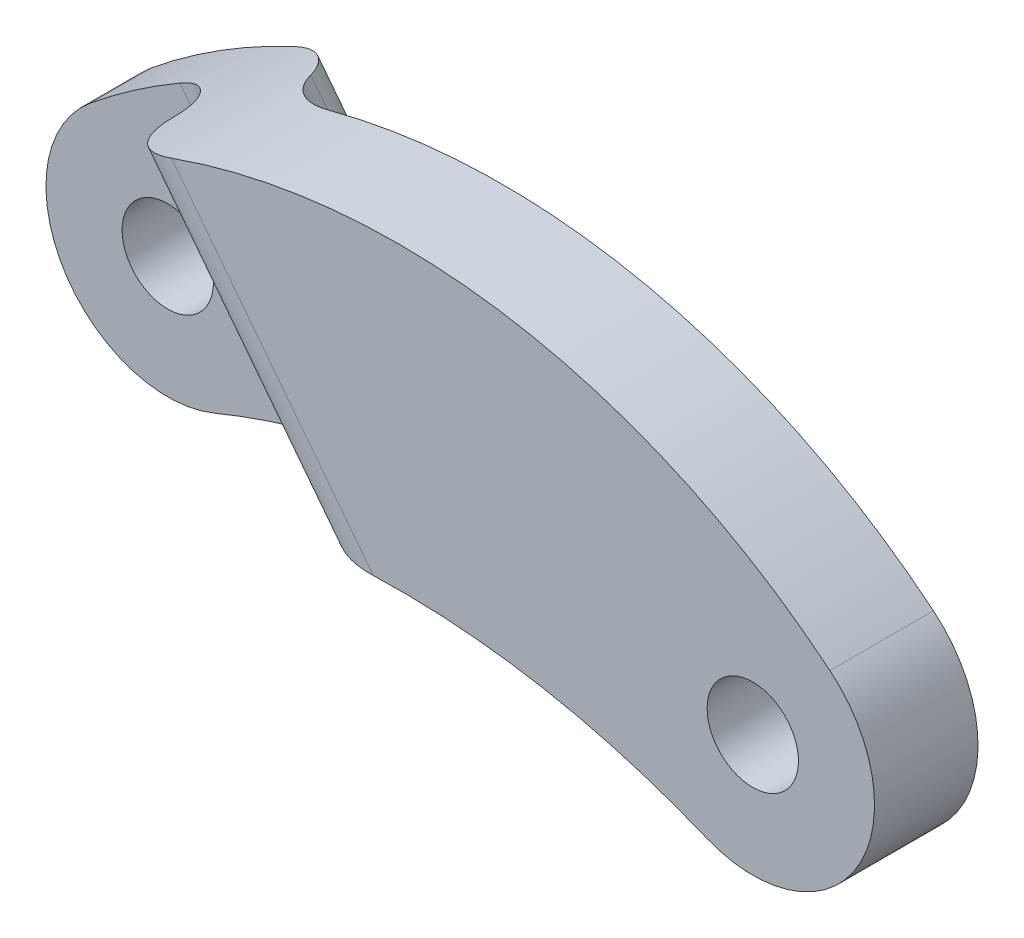
ISO-10303-21;
HEADER;
FILE_DESCRIPTION(('STEP AP214'),'2;1');
FILE_NAME('part.step','',(''),(''),'','','');
FILE_SCHEMA(('AUTOMOTIVE_DESIGN { 1 0 10303 214 1 1 1 1 }'));
ENDSEC;
DATA;
#1=APPLICATION_CONTEXT('core data for automotive mechanical design processes');
#2=APPLICATION_PROTOCOL_DEFINITION('international standard','automotive_design',2000,#1);
#3=PRODUCT_CONTEXT('',#1,'mechanical');
#4=PRODUCT('Part','Part','',(#3));
#5=PRODUCT_RELATED_PRODUCT_CATEGORY('part','',(#4));
#6=PRODUCT_DEFINITION_FORMATION('','',#4);
#7=PRODUCT_DEFINITION_CONTEXT('part definition',#1,'design');
#8=PRODUCT_DEFINITION('design','',#6,#7);
#9=PRODUCT_DEFINITION_SHAPE('','',#8);
#10=(LENGTH_UNIT() NAMED_UNIT(*) SI_UNIT(.MILLI.,.METRE.));
#11=(NAMED_UNIT(*) PLANE_ANGLE_UNIT() SI_UNIT($,.RADIAN.));
#12=(NAMED_UNIT(*) SI_UNIT($,.STERADIAN.) SOLID_ANGLE_UNIT());
#13=UNCERTAINTY_MEASURE_WITH_UNIT(LENGTH_MEASURE(1.E-05),#10,'distance_accuracy_value','');
#14=(GEOMETRIC_REPRESENTATION_CONTEXT(3) GLOBAL_UNCERTAINTY_ASSIGNED_CONTEXT((#13)) GLOBAL_UNIT_ASSIGNED_CONTEXT((#10,
#11,#12)) REPRESENTATION_CONTEXT('',''));
#15=CARTESIAN_POINT('',(0.,0.,0.));
#16=DIRECTION('',(0.,0.,1.));
#17=DIRECTION('',(1.,0.,0.));
#18=AXIS2_PLACEMENT_3D('',#15,#16,#17);
#19=CARTESIAN_POINT('',(0.,0.,0.5));
#20=DIRECTION('',(0.,0.,1.));
#21=DIRECTION('',(-1.,0.,0.));
#22=AXIS2_PLACEMENT_3D('',#19,#20,#21);
#23=PLANE('',#22);
#24=CARTESIAN_POINT('',(-5.80500000000001,-7.08580023417827,0.5));
#25=DIRECTION('',(0.,0.,-1.));
#26=DIRECTION('',(1.,0.,0.));
#27=AXIS2_PLACEMENT_3D('',#24,#25,#26);
#28=CIRCLE('',#27,11.1600540368865);
#29=CARTESIAN_POINT('',(-12.8774597718799,1.54710882832013,0.5));
#30=VERTEX_POINT('',#29);
#31=CARTESIAN_POINT('',(-11.409561525458,2.56488348323696,0.5));
#32=VERTEX_POINT('',#31);
#33=EDGE_CURVE('E149',#30,#32,#28,.T.);
#34=ORIENTED_EDGE('',*,*,#33,.F.);
#35=CARTESIAN_POINT('',(-11.61,0.,0.5));
#36=DIRECTION('',(0.,0.,-1.));
#37=DIRECTION('',(-1.,0.,0.));
#38=AXIS2_PLACEMENT_3D('',#35,#36,#37);
#39=CIRCLE('',#38,2.);
#40=CARTESIAN_POINT('',(-10.8446077432324,-1.8477485470919,0.5));
#41=VERTEX_POINT('',#40);
#42=EDGE_CURVE('E159',#41,#30,#39,.T.);
#43=ORIENTED_EDGE('',*,*,#42,.F.);
#44=CARTESIAN_POINT('',(-5.805,-14.0139650238523,0.5));
#45=DIRECTION('',(0.,0.,-1.));
#46=DIRECTION('',(1.,0.,0.));
#47=AXIS2_PLACEMENT_3D('',#44,#45,#46);
#48=CIRCLE('',#47,13.1686927811778);
#49=CARTESIAN_POINT('',(-8.54411179028973,-1.13329205364845,0.5));
#50=VERTEX_POINT('',#49);
#51=EDGE_CURVE('E260',#41,#50,#48,.T.);
#52=ORIENTED_EDGE('',*,*,#51,.T.);
#53=DIRECTION('',(-0.612486689037816,0.790480901572893,0.));
#54=VECTOR('',#53,1.);
#55=CARTESIAN_POINT('',(-5.88756775120085,-4.56185199571997,0.5));
#56=LINE('',#55,#54);
#57=EDGE_CURVE('E202',#32,#50,#56,.F.);
#58=ORIENTED_EDGE('',*,*,#57,.F.);
#59=EDGE_LOOP('',(#34,#43,#52,#58));
#60=FACE_BOUND('',#59,.T.);
#61=CARTESIAN_POINT('',(-11.61,0.,0.5));
#62=DIRECTION('',(0.,0.,-1.));
#63=DIRECTION('',(-1.,0.,0.));
#64=AXIS2_PLACEMENT_3D('',#61,#62,#63);
#65=CIRCLE('',#64,0.750000000000002);
#66=CARTESIAN_POINT('',(-12.36,0.,0.5));
#67=VERTEX_POINT('',#66);
#68=EDGE_CURVE('E153',#67,#67,#65,.T.);
#69=ORIENTED_EDGE('',*,*,#68,.T.);
#70=EDGE_LOOP('',(#69));
#71=FACE_BOUND('',#70,.T.);
#72=ADVANCED_FACE('F35',(#60,#71),#23,.T.);
#73=CARTESIAN_POINT('',(0.,0.,-0.5));
#74=DIRECTION('',(0.,0.,1.));
#75=DIRECTION('',(-1.,0.,0.));
#76=AXIS2_PLACEMENT_3D('',#73,#74,#75);
#77=PLANE('',#76);
#78=CARTESIAN_POINT('',(-5.805,-14.0139650238523,-0.5));
#79=DIRECTION('',(0.,0.,-1.));
#80=DIRECTION('',(1.,0.,0.));
#81=AXIS2_PLACEMENT_3D('',#78,#79,#80);
#82=CIRCLE('',#81,13.1686927811778);
#83=CARTESIAN_POINT('',(-10.8446077432324,-1.8477485470919,-0.5));
#84=VERTEX_POINT('',#83);
#85=CARTESIAN_POINT('',(-7.42474680096433,-0.945266164906543,-0.5));
#86=VERTEX_POINT('',#85);
#87=EDGE_CURVE('E261',#84,#86,#82,.T.);
#88=ORIENTED_EDGE('',*,*,#87,.F.);
#89=CARTESIAN_POINT('',(-11.61,0.,-0.5));
#90=DIRECTION('',(0.,0.,-1.));
#91=DIRECTION('',(-1.,0.,0.));
#92=AXIS2_PLACEMENT_3D('',#89,#90,#91);
#93=CIRCLE('',#92,2.);
#94=CARTESIAN_POINT('',(-12.8774597718799,1.54710882832013,-0.5));
#95=VERTEX_POINT('',#94);
#96=EDGE_CURVE('E156',#84,#95,#93,.T.);
#97=ORIENTED_EDGE('',*,*,#96,.T.);
#98=CARTESIAN_POINT('',(-5.80500000000001,-7.08580023417827,-0.5));
#99=DIRECTION('',(0.,0.,-1.));
#100=DIRECTION('',(1.,0.,0.));
#101=AXIS2_PLACEMENT_3D('',#98,#99,#100);
#102=CIRCLE('',#101,11.1600540368865);
#103=CARTESIAN_POINT('',(-10.5085085495051,3.03466484559743,-0.5));
#104=VERTEX_POINT('',#103);
#105=EDGE_CURVE('E144',#95,#104,#102,.T.);
#106=ORIENTED_EDGE('',*,*,#105,.T.);
#107=DIRECTION('',(-0.612486689037816,0.790480901572893,0.));
#108=VECTOR('',#107,1.);
#109=CARTESIAN_POINT('',(-5.09708684962795,-3.94936530668216,-0.5));
#110=LINE('',#109,#108);
#111=EDGE_CURVE('E162',#86,#104,#110,.T.);
#112=ORIENTED_EDGE('',*,*,#111,.F.);
#113=EDGE_LOOP('',(#88,#97,#106,#112));
#114=FACE_BOUND('',#113,.T.);
#115=CARTESIAN_POINT('',(-11.61,0.,-0.5));
#116=DIRECTION('',(0.,0.,-1.));
#117=DIRECTION('',(-1.,0.,0.));
#118=AXIS2_PLACEMENT_3D('',#115,#116,#117);
#119=CIRCLE('',#118,0.750000000000002);
#120=CARTESIAN_POINT('',(-12.36,0.,-0.5));
#121=VERTEX_POINT('',#120);
#122=EDGE_CURVE('E146',#121,#121,#119,.T.);
#123=ORIENTED_EDGE('',*,*,#122,.F.);
#124=EDGE_LOOP('',(#123));
#125=FACE_BOUND('',#124,.T.);
#126=ADVANCED_FACE('F220',(#114,#125),#77,.F.);
#127=CARTESIAN_POINT('',(0.,0.,0.5));
#128=DIRECTION('',(0.,0.,-1.));
#129=DIRECTION('',(1.,0.,0.));
#130=AXIS2_PLACEMENT_3D('',#127,#128,#129);
#131=CYLINDRICAL_SURFACE('',#130,2.);
#132=DIRECTION('',(0.,0.,1.));
#133=VECTOR('',#132,1.);
#134=CARTESIAN_POINT('',(1.26745977187993,1.54710882832013,-0.5));
#135=LINE('',#134,#133);
#136=CARTESIAN_POINT('',(1.26745977187993,1.54710882832013,0.8));
#137=VERTEX_POINT('',#136);
#138=CARTESIAN_POINT('',(1.26745977187993,1.54710882832013,2.5));
#139=VERTEX_POINT('',#138);
#140=EDGE_CURVE('E132',#137,#139,#135,.T.);
#141=ORIENTED_EDGE('',*,*,#140,.T.);
#142=CARTESIAN_POINT('',(0.,0.,2.5));
#143=DIRECTION('',(0.,0.,-1.));
#144=DIRECTION('',(-1.,0.,0.));
#145=AXIS2_PLACEMENT_3D('',#142,#143,#144);
#146=CIRCLE('',#145,2.);
#147=CARTESIAN_POINT('',(-0.765392256767593,-1.8477485470919,2.5));
#148=VERTEX_POINT('',#147);
#149=EDGE_CURVE('E268',#139,#148,#146,.T.);
#150=ORIENTED_EDGE('',*,*,#149,.T.);
#151=DIRECTION('',(0.,0.,1.));
#152=VECTOR('',#151,1.);
#153=CARTESIAN_POINT('',(-0.765392256767595,-1.8477485470919,-0.5));
#154=LINE('',#153,#152);
#155=CARTESIAN_POINT('',(-0.765392256767593,-1.8477485470919,0.8));
#156=VERTEX_POINT('',#155);
#157=EDGE_CURVE('E134',#156,#148,#154,.T.);
#158=ORIENTED_EDGE('',*,*,#157,.F.);
#159=CARTESIAN_POINT('',(0.,0.,0.8));
#160=DIRECTION('',(0.,0.,-1.));
#161=DIRECTION('',(-1.,0.,0.));
#162=AXIS2_PLACEMENT_3D('',#159,#160,#161);
#163=CIRCLE('',#162,2.);
#164=EDGE_CURVE('E120',#137,#156,#163,.T.);
#165=ORIENTED_EDGE('',*,*,#164,.F.);
#166=EDGE_LOOP('',(#141,#150,#158,#165));
#167=FACE_BOUND('',#166,.T.);
#168=ADVANCED_FACE('F130',(#167),#131,.T.);
#169=CARTESIAN_POINT('',(-11.61,0.,0.5));
#170=DIRECTION('',(0.,0.,-1.));
#171=DIRECTION('',(1.,0.,0.));
#172=AXIS2_PLACEMENT_3D('',#169,#170,#171);
#173=CYLINDRICAL_SURFACE('',#172,2.);
#174=ORIENTED_EDGE('',*,*,#96,.F.);
#175=DIRECTION('',(0.,0.,1.));
#176=VECTOR('',#175,1.);
#177=CARTESIAN_POINT('',(-10.8446077432324,-1.8477485470919,-0.5));
#178=LINE('',#177,#176);
#179=EDGE_CURVE('E265',#84,#41,#178,.T.);
#180=ORIENTED_EDGE('',*,*,#179,.T.);
#181=ORIENTED_EDGE('',*,*,#42,.T.);
#182=DIRECTION('',(0.,0.,1.));
#183=VECTOR('',#182,1.);
#184=CARTESIAN_POINT('',(-12.8774597718799,1.54710882832013,-0.5));
#185=LINE('',#184,#183);
#186=EDGE_CURVE('E143',#95,#30,#185,.T.);
#187=ORIENTED_EDGE('',*,*,#186,.F.);
#188=EDGE_LOOP('',(#174,#180,#181,#187));
#189=FACE_BOUND('',#188,.T.);
#190=ADVANCED_FACE('F232',(#189),#173,.T.);
#191=CARTESIAN_POINT('',(0.,0.,0.5));
#192=DIRECTION('',(0.,0.,-1.));
#193=DIRECTION('',(1.,0.,0.));
#194=AXIS2_PLACEMENT_3D('',#191,#192,#193);
#195=CYLINDRICAL_SURFACE('',#194,0.75);
#196=CARTESIAN_POINT('',(0.,0.,0.8));
#197=DIRECTION('',(0.,0.,-1.));
#198=DIRECTION('',(-1.,0.,0.));
#199=AXIS2_PLACEMENT_3D('',#196,#197,#198);
#200=CIRCLE('',#199,0.75);
#201=CARTESIAN_POINT('',(-0.75,0.,0.8));
#202=VERTEX_POINT('',#201);
#203=EDGE_CURVE('E281',#202,#202,#200,.T.);
#204=ORIENTED_EDGE('',*,*,#203,.T.);
#205=EDGE_LOOP('',(#204));
#206=FACE_BOUND('',#205,.T.);
#207=CARTESIAN_POINT('',(0.,0.,2.5));
#208=DIRECTION('',(0.,0.,-1.));
#209=DIRECTION('',(-1.,0.,0.));
#210=AXIS2_PLACEMENT_3D('',#207,#208,#209);
#211=CIRCLE('',#210,0.75);
#212=CARTESIAN_POINT('',(-0.75,0.,2.5));
#213=VERTEX_POINT('',#212);
#214=EDGE_CURVE('E284',#213,#213,#211,.T.);
#215=ORIENTED_EDGE('',*,*,#214,.F.);
#216=EDGE_LOOP('',(#215));
#217=FACE_BOUND('',#216,.T.);
#218=ADVANCED_FACE('F230',(#206,#217),#195,.F.);
#219=CARTESIAN_POINT('',(-11.61,0.,0.5));
#220=DIRECTION('',(0.,0.,-1.));
#221=DIRECTION('',(1.,0.,0.));
#222=AXIS2_PLACEMENT_3D('',#219,#220,#221);
#223=CYLINDRICAL_SURFACE('',#222,0.750000000000002);
#224=ORIENTED_EDGE('',*,*,#68,.F.);
#225=EDGE_LOOP('',(#224));
#226=FACE_BOUND('',#225,.T.);
#227=ORIENTED_EDGE('',*,*,#122,.T.);
#228=EDGE_LOOP('',(#227));
#229=FACE_BOUND('',#228,.T.);
#230=ADVANCED_FACE('F187',(#226,#229),#223,.F.);
#231=CARTESIAN_POINT('',(-5.80500000000001,-7.08580023417827,-0.5));
#232=DIRECTION('',(0.,0.,1.));
#233=DIRECTION('',(-1.,0.,0.));
#234=AXIS2_PLACEMENT_3D('',#231,#232,#233);
#235=CYLINDRICAL_SURFACE('',#234,11.1600540368865);
#236=ORIENTED_EDGE('',*,*,#105,.F.);
#237=ORIENTED_EDGE('',*,*,#186,.T.);
#238=ORIENTED_EDGE('',*,*,#33,.T.);
#239=CARTESIAN_POINT('',(-10.5085085495051,3.03466484559743,1.5));
#240=CARTESIAN_POINT('',(-10.5085079821643,3.03466443992367,1.47231611605151));
#241=CARTESIAN_POINT('',(-10.509578539391,3.0341676381714,1.44464574662319));
#242=CARTESIAN_POINT('',(-10.5138445706943,3.03218361238759,1.3895082622763));
#243=CARTESIAN_POINT('',(-10.5170397974425,3.03069650363563,1.36204112407624));
#244=CARTESIAN_POINT('',(-10.5297657242431,3.02476295467184,1.28033488413742));
#245=CARTESIAN_POINT('',(-10.5424368653114,3.01884425450083,1.22665150853327));
#246=CARTESIAN_POINT('',(-10.5756898838789,3.00318670254221,1.12240899322599));
#247=CARTESIAN_POINT('',(-10.5962729563652,2.99344727368213,1.07185032680633));
#248=CARTESIAN_POINT('',(-10.6446233606778,2.97032065843732,0.975193292122565));
#249=CARTESIAN_POINT('',(-10.6723913485879,2.95693313892467,0.929095331712096));
#250=CARTESIAN_POINT('',(-10.7345968263325,2.92654672762075,0.841995767513028));
#251=CARTESIAN_POINT('',(-10.7691175658354,2.90950247062166,0.801069521491699));
#252=CARTESIAN_POINT('',(-10.8434925496988,2.8722179701158,0.72608035945098));
#253=CARTESIAN_POINT('',(-10.8833482000331,2.85197688385599,0.692019258636275));
#254=CARTESIAN_POINT('',(-10.9680629441004,2.80823353494426,0.631009018741774));
#255=CARTESIAN_POINT('',(-11.013009337538,2.78467185600187,0.604223748718969));
#256=CARTESIAN_POINT('',(-11.1058430609583,2.73512797388139,0.559465265795672));
#257=CARTESIAN_POINT('',(-11.1537288651537,2.70914702293657,0.54148752389495));
#258=CARTESIAN_POINT('',(-11.2364880243384,2.66341844787549,0.518827086077654));
#259=CARTESIAN_POINT('',(-11.2709822205243,2.64412313661005,0.511778229823213));
#260=CARTESIAN_POINT('',(-11.3402033737145,2.60491335431612,0.502364024312786));
#261=CARTESIAN_POINT('',(-11.374930020999,2.58499961323456,0.49999335185671));
#262=CARTESIAN_POINT('',(-11.409561525458,2.56488348323696,0.5));
#263=B_SPLINE_CURVE_WITH_KNOTS('',3,(#239,#240,#241,#242,#243,#244,#245,#246,#247,#248,#249,
#250,#251,#252,#253,#254,#255,#256,#257,#258,#259,#260,#261,#262),.UNSPECIFIED.,.F.,.F.,(4,2,2,
2,2,2,2,2,2,2,2,4),(0.,0.0829998028282258,0.165989945510503,0.331557292873975,0.497149656712741,
0.662757146802546,0.830552065641355,0.998391292895606,1.16974525724486,1.34101101536481,
1.46119089358887,1.58123394279946),.UNSPECIFIED.);
#264=CARTESIAN_POINT('',(-10.5085085495051,3.03466484559743,1.5));
#265=VERTEX_POINT('',#264);
#266=EDGE_CURVE('E48',#265,#32,#263,.T.);
#267=ORIENTED_EDGE('',*,*,#266,.F.);
#268=CARTESIAN_POINT('',(-9.54808119356654,3.42781709215597,2.5));
#269=CARTESIAN_POINT('',(-9.60479113928533,3.40764729536137,2.50004466491557));
#270=CARTESIAN_POINT('',(-9.66134807675275,3.38697524235907,2.49509619546598));
#271=CARTESIAN_POINT('',(-9.7726530375485,3.34530504808339,2.47534028925758));
#272=CARTESIAN_POINT('',(-9.82739914336134,3.3243065937048,2.46052273200392));
#273=CARTESIAN_POINT('',(-9.93353735035689,3.28267467020534,2.4211264560919));
#274=CARTESIAN_POINT('',(-9.9849242198029,3.26204180524963,2.39653291493059));
#275=CARTESIAN_POINT('',(-10.082654603678,3.22202486408923,2.33812752979995));
#276=CARTESIAN_POINT('',(-10.1290022964875,3.20263975879507,2.3043234058774));
#277=CARTESIAN_POINT('',(-10.2138251008774,3.16657163373209,2.22959565288845));
#278=CARTESIAN_POINT('',(-10.2525076857137,3.14982110291029,2.18894020604948));
#279=CARTESIAN_POINT('',(-10.3226578803333,3.11905373631276,2.10089282178147));
#280=CARTESIAN_POINT('',(-10.3541241778452,3.10503739781499,2.05349966164348));
#281=CARTESIAN_POINT('',(-10.4079111552897,3.08085398540459,1.95511546541881));
#282=CARTESIAN_POINT('',(-10.430508724499,3.07057128319713,1.90430380427422));
#283=CARTESIAN_POINT('',(-10.4673865561996,3.05369545668609,1.79919538324296));
#284=CARTESIAN_POINT('',(-10.4816749731903,3.04709871527602,1.74490209849027));
#285=CARTESIAN_POINT('',(-10.4972319321875,3.03989982669158,1.65846142834048));
#286=CARTESIAN_POINT('',(-10.5014596976246,3.03793860201241,1.62692543100499));
#287=CARTESIAN_POINT('',(-10.5070963360006,3.0353212397165,1.56359799644812));
#288=CARTESIAN_POINT('',(-10.5085095460513,3.03466309411866,1.53180702815453));
#289=CARTESIAN_POINT('',(-10.5085085495051,3.03466484559743,1.5));
#290=B_SPLINE_CURVE_WITH_KNOTS('',3,(#268,#269,#270,#271,#272,#273,#274,#275,#276,#277,#278,
#279,#280,#281,#282,#283,#284,#285,#286,#287,#288,#289),.UNSPECIFIED.,.F.,.F.,(4,2,2,2,2,2,2,2,
2,2,4),(0.,0.180402825065742,0.360990933993724,0.541853904341653,0.722565744398397,
0.897383264136049,1.07223254901905,1.24107913791347,1.40975974198445,1.50525834491122,
1.60060967427656),.UNSPECIFIED.);
#291=CARTESIAN_POINT('',(-9.54808119356654,3.42781709215597,2.5));
#292=VERTEX_POINT('',#291);
#293=EDGE_CURVE('E167',#292,#265,#290,.T.);
#294=ORIENTED_EDGE('',*,*,#293,.F.);
#295=CARTESIAN_POINT('',(-5.80500000000001,-7.08580023417827,2.5));
#296=DIRECTION('',(0.,0.,-1.));
#297=DIRECTION('',(-1.,0.,0.));
#298=AXIS2_PLACEMENT_3D('',#295,#296,#297);
#299=CIRCLE('',#298,11.1600540368865);
#300=EDGE_CURVE('E141',#292,#139,#299,.T.);
#301=ORIENTED_EDGE('',*,*,#300,.T.);
#302=ORIENTED_EDGE('',*,*,#140,.F.);
#303=CARTESIAN_POINT('',(-5.80500000000001,-7.08580023417827,0.8));
#304=DIRECTION('',(0.,0.,-1.));
#305=DIRECTION('',(-1.,0.,0.));
#306=AXIS2_PLACEMENT_3D('',#303,#304,#305);
#307=CIRCLE('',#306,11.1600540368865);
#308=CARTESIAN_POINT('',(-8.65683845296873,3.70372355255096,0.8));
#309=VERTEX_POINT('',#308);
#310=EDGE_CURVE('E116',#309,#137,#307,.T.);
#311=ORIENTED_EDGE('',*,*,#310,.F.);
#312=CARTESIAN_POINT('',(-9.61066818006019,3.40532438663833,0.15));
#313=CARTESIAN_POINT('',(-9.60104391336495,3.40881513212217,0.176085519654819));
#314=CARTESIAN_POINT('',(-9.59035270948725,3.41267886889881,0.201711384994293));
#315=CARTESIAN_POINT('',(-9.56692228490636,3.42109770255776,0.251883180060699));
#316=CARTESIAN_POINT('',(-9.55418357356539,3.4256526274762,0.276429376449546));
#317=CARTESIAN_POINT('',(-9.51311083071071,3.4402418270236,0.348062977268186));
#318=CARTESIAN_POINT('',(-9.48185314641106,3.45122516300105,0.393325980241011));
#319=CARTESIAN_POINT('',(-9.4125827096049,3.47514153822328,0.477657776101736));
#320=CARTESIAN_POINT('',(-9.37457331896887,3.4880736066538,0.516729633505074));
#321=CARTESIAN_POINT('',(-9.29289466341916,3.51529629407549,0.587873425484103));
#322=CARTESIAN_POINT('',(-9.24922349954141,3.529587368448,0.619943001757442));
#323=CARTESIAN_POINT('',(-9.15586292799793,3.55943368433884,0.677444969317043));
#324=CARTESIAN_POINT('',(-9.1060176386546,3.57501555106899,0.702609523057617));
#325=CARTESIAN_POINT('',(-9.00292882872925,3.60639124509719,0.744433990444252));
#326=CARTESIAN_POINT('',(-8.94968442431669,3.6221851266729,0.761091681938328));
#327=CARTESIAN_POINT('',(-8.85635965322597,3.64908058369192,0.782322576424806));
#328=CARTESIAN_POINT('',(-8.81675765428668,3.66026027275357,0.788971798337664));
#329=CARTESIAN_POINT('',(-8.73707083994223,3.68227710299579,0.797806425010267));
#330=CARTESIAN_POINT('',(-8.69698747212269,3.69311502773634,0.800002902382102));
#331=CARTESIAN_POINT('',(-8.65683845296873,3.70372355255096,0.8));
#332=B_SPLINE_CURVE_WITH_KNOTS('',3,(#312,#313,#314,#315,#316,#317,#318,#319,#320,#321,#322,
#323,#324,#325,#326,#327,#328,#329,#330,#331),.UNSPECIFIED.,.F.,.F.,(4,2,2,2,2,2,2,2,2,4),(0.,
0.084012468830498,0.168004069980026,0.335412368609916,0.502737542267542,0.670118982841301,
0.843288013287649,1.01650225562468,1.14132138333945,1.26582974147891),.UNSPECIFIED.);
#333=CARTESIAN_POINT('',(-9.61066818006019,3.40532438663833,0.150000000000001));
#334=VERTEX_POINT('',#333);
#335=EDGE_CURVE('E195',#334,#309,#332,.T.);
#336=ORIENTED_EDGE('',*,*,#335,.F.);
#337=CARTESIAN_POINT('',(-10.5085085495051,3.03466484559743,-0.5));
#338=CARTESIAN_POINT('',(-10.4545997913314,3.05973895002356,-0.500038307200525));
#339=CARTESIAN_POINT('',(-10.4004991351627,3.08433910603536,-0.494961999885077));
#340=CARTESIAN_POINT('',(-10.2934827304667,3.13201024938711,-0.474986815324863));
#341=CARTESIAN_POINT('',(-10.2405663411904,3.15508207755746,-0.460093389332842));
#342=CARTESIAN_POINT('',(-10.1374120896524,3.19914943907394,-0.420885271336029));
#343=CARTESIAN_POINT('',(-10.0871748457609,3.22014449403035,-0.396568414935799));
#344=CARTESIAN_POINT('',(-9.99090245106407,3.25962039999629,-0.33916165681637));
#345=CARTESIAN_POINT('',(-9.94486686555581,3.27810151119532,-0.306072664047405));
#346=CARTESIAN_POINT('',(-9.85852226097701,3.31217652495307,-0.231988760963064));
#347=CARTESIAN_POINT('',(-9.81820664943204,3.3277737576782,-0.191003082518444));
#348=CARTESIAN_POINT('',(-9.74466284481199,3.35581916156376,-0.102143245266141));
#349=CARTESIAN_POINT('',(-9.71143499904493,3.36826717841484,-0.0542687490914888));
#350=CARTESIAN_POINT('',(-9.65429153012761,3.38944029916484,0.0454597621794512));
#351=CARTESIAN_POINT('',(-9.63012023971885,3.39826841148349,0.0971454374043927));
#352=CARTESIAN_POINT('',(-9.59071155312003,3.41256338698437,0.204223596234319));
#353=CARTESIAN_POINT('',(-9.57546274942595,3.41803454251251,0.259611245370437));
#354=CARTESIAN_POINT('',(-9.55938610441248,3.42378701122959,0.346264680392394));
#355=CARTESIAN_POINT('',(-9.5551505994438,3.42529822380831,0.376857090287763));
#356=CARTESIAN_POINT('',(-9.54949872009529,3.4273124958907,0.438294114106932));
#357=CARTESIAN_POINT('',(-9.54807871887972,3.4278168523977,0.469138352108181));
#358=CARTESIAN_POINT('',(-9.54808119356653,3.42781709215597,0.5));
#359=B_SPLINE_CURVE_WITH_KNOTS('',3,(#337,#338,#339,#340,#341,#342,#343,#344,#345,#346,#347,
#348,#349,#350,#351,#352,#353,#354,#355,#356,#357,#358),.UNSPECIFIED.,.F.,.F.,(4,2,2,2,2,2,2,2,
2,2,4),(0.,0.178110237207162,0.356121656526966,0.534173986179928,0.712207873632867,
0.890034874192797,1.06787058646342,1.24021984957285,1.41234827791813,1.50498191224225,
1.59749614135646),.UNSPECIFIED.);
#360=EDGE_CURVE('E175',#104,#334,#359,.T.);
#361=ORIENTED_EDGE('',*,*,#360,.F.);
#362=EDGE_LOOP('',(#236,#237,#238,#267,#294,#301,#302,#311,#336,#361));
#363=FACE_BOUND('',#362,.T.);
#364=ADVANCED_FACE('F138',(#363),#235,.T.);
#365=CARTESIAN_POINT('',(-5.805,-14.0139650238523,-0.5));
#366=DIRECTION('',(0.,0.,1.));
#367=DIRECTION('',(-1.,0.,0.));
#368=AXIS2_PLACEMENT_3D('',#365,#366,#367);
#369=CYLINDRICAL_SURFACE('',#368,13.1686927811778);
#370=CARTESIAN_POINT('',(-5.805,-14.0139650238523,0.8));
#371=DIRECTION('',(0.,0.,1.));
#372=DIRECTION('',(-1.,0.,0.));
#373=AXIS2_PLACEMENT_3D('',#370,#371,#372);
#374=CIRCLE('',#373,13.1686927811778);
#375=CARTESIAN_POINT('',(-5.11826569497717,-0.863190690781676,0.8));
#376=VERTEX_POINT('',#375);
#377=EDGE_CURVE('E135',#156,#376,#374,.T.);
#378=ORIENTED_EDGE('',*,*,#377,.F.);
#379=ORIENTED_EDGE('',*,*,#157,.T.);
#380=CARTESIAN_POINT('',(-5.805,-14.0139650238523,2.5));
#381=DIRECTION('',(0.,0.,1.));
#382=DIRECTION('',(-1.,0.,0.));
#383=AXIS2_PLACEMENT_3D('',#380,#381,#382);
#384=CIRCLE('',#383,13.1686927811778);
#385=CARTESIAN_POINT('',(-6.23181151562507,-0.852190770539253,2.5));
#386=VERTEX_POINT('',#385);
#387=EDGE_CURVE('E262',#148,#386,#384,.T.);
#388=ORIENTED_EDGE('',*,*,#387,.T.);
#389=CARTESIAN_POINT('',(-7.42474680096433,-0.945266164906542,1.5));
#390=CARTESIAN_POINT('',(-7.42474824378731,-0.945266805260724,1.5251876114769));
#391=CARTESIAN_POINT('',(-7.42364760094938,-0.945129883128837,1.55036213796094));
#392=CARTESIAN_POINT('',(-7.41926783501788,-0.944587983045424,1.60051057315308));
#393=CARTESIAN_POINT('',(-7.41598936885114,-0.944183085927016,1.62548454006029));
#394=CARTESIAN_POINT('',(-7.40296791242617,-0.942582209871265,1.69962114137935));
#395=CARTESIAN_POINT('',(-7.39003827036568,-0.940999900524855,1.74825137526711));
#396=CARTESIAN_POINT('',(-7.35628758605538,-0.936952357713761,1.84256346119557));
#397=CARTESIAN_POINT('',(-7.33547223004426,-0.934487760520435,1.88824741003447));
#398=CARTESIAN_POINT('',(-7.28682787878807,-0.928887515436232,1.97569551630254));
#399=CARTESIAN_POINT('',(-7.25899338327209,-0.925751341582929,2.01745656431781));
#400=CARTESIAN_POINT('',(-7.19590447943489,-0.918893270451528,2.09811120771486));
#401=CARTESIAN_POINT('',(-7.16036195753881,-0.915150719694756,2.1367765580781));
#402=CARTESIAN_POINT('',(-7.08397796696187,-0.907472013976818,2.20838893250842));
#403=CARTESIAN_POINT('',(-7.04313619660805,-0.903535848001549,2.24133563077714));
#404=CARTESIAN_POINT('',(-6.95171261162994,-0.895204278481867,2.30518013871335));
#405=CARTESIAN_POINT('',(-6.90055499967352,-0.890815811476065,2.33525260871471));
#406=CARTESIAN_POINT('',(-6.79437103325472,-0.882382057794862,2.38777365229687));
#407=CARTESIAN_POINT('',(-6.73933781510464,-0.878337409466836,2.41020826750891));
#408=CARTESIAN_POINT('',(-6.61040895197262,-0.869725814924579,2.45295236657057));
#409=CARTESIAN_POINT('',(-6.53567152918667,-0.865347561763234,2.47075877370386));
#410=CARTESIAN_POINT('',(-6.38450619811651,-0.857805138771778,2.49426593823586));
#411=CARTESIAN_POINT('',(-6.30808516338805,-0.854636751207356,2.50000907078756));
#412=CARTESIAN_POINT('',(-6.23181151562507,-0.852190770539256,2.5));
#413=B_SPLINE_CURVE_WITH_KNOTS('',3,(#389,#390,#391,#392,#393,#394,#395,#396,#397,#398,#399,
#400,#401,#402,#403,#404,#405,#406,#407,#408,#409,#410,#411,#412),.UNSPECIFIED.,.F.,.F.,(4,2,2,
2,2,2,2,2,2,2,2,4),(0.,0.075512914475057,0.151003061287907,0.301235016897313,0.451358848653137,
0.601600686560247,0.75893094537527,0.916270164541143,1.09409584748994,1.27224478836875,
1.50205736322303,1.73106130675919),.UNSPECIFIED.);
#414=CARTESIAN_POINT('',(-7.42474680096433,-0.945266164906542,1.5));
#415=VERTEX_POINT('',#414);
#416=EDGE_CURVE('E248',#415,#386,#413,.T.);
#417=ORIENTED_EDGE('',*,*,#416,.F.);
#418=CARTESIAN_POINT('',(-8.54411179028973,-1.13329205364845,0.5));
#419=CARTESIAN_POINT('',(-8.47620645867082,-1.11883042336752,0.499991154604004));
#420=CARTESIAN_POINT('',(-8.40819210493737,-1.10494910049924,0.505864592847744));
#421=CARTESIAN_POINT('',(-8.273730489546,-1.07857190118771,0.529045048238693));
#422=CARTESIAN_POINT('',(-8.20728631081606,-1.0660785966128,0.546372889815682));
#423=CARTESIAN_POINT('',(-8.07797175088626,-1.04274960768125,0.59214280443788));
#424=CARTESIAN_POINT('',(-8.01510360419864,-1.03191495274738,0.620591741064491));
#425=CARTESIAN_POINT('',(-7.89507451139023,-1.01205183979277,0.688169427405429));
#426=CARTESIAN_POINT('',(-7.83791071776311,-1.00302247832128,0.727292811843936));
#427=CARTESIAN_POINT('',(-7.73368656140914,-0.987172855159449,0.81388034261669));
#428=CARTESIAN_POINT('',(-7.68631856181271,-0.980280025767659,0.860958582686055));
#429=CARTESIAN_POINT('',(-7.60137508682262,-0.96830095643697,0.963502861158073));
#430=CARTESIAN_POINT('',(-7.5637931128776,-0.963213516784255,1.01896329436761));
#431=CARTESIAN_POINT('',(-7.50485278017103,-0.95541434126254,1.1292323721004));
#432=CARTESIAN_POINT('',(-7.48205360562619,-0.952485120371871,1.18325576179941));
#433=CARTESIAN_POINT('',(-7.44738159915649,-0.948079424381282,1.29469045851749));
#434=CARTESIAN_POINT('',(-7.43547590737595,-0.946598579361933,1.35209101712759));
#435=CARTESIAN_POINT('',(-7.42786880123096,-0.945653499235207,1.42495656790778));
#436=CARTESIAN_POINT('',(-7.42669812362994,-0.945508173429303,1.43995090588103));
#437=CARTESIAN_POINT('',(-7.42513844435503,-0.945314652297461,1.46996101233869));
#438=CARTESIAN_POINT('',(-7.42474841411406,-0.945266329162281,1.48497672650312));
#439=CARTESIAN_POINT('',(-7.42474680096433,-0.945266164906538,1.5));
#440=B_SPLINE_CURVE_WITH_KNOTS('',3,(#418,#419,#420,#421,#422,#423,#424,#425,#426,#427,#428,
#429,#430,#431,#432,#433,#434,#435,#436,#437,#438,#439),.UNSPECIFIED.,.F.,.F.,(4,2,2,2,2,2,2,2,
2,2,4),(0.,0.208022654760259,0.416424544568668,0.624955256884633,0.833381348311818,
1.03365852341593,1.23380236043066,1.40892580740925,1.58351924143488,1.62862831323804,
1.6736779109015),.UNSPECIFIED.);
#441=EDGE_CURVE('E11',#50,#415,#440,.T.);
#442=ORIENTED_EDGE('',*,*,#441,.F.);
#443=ORIENTED_EDGE('',*,*,#51,.F.);
#444=ORIENTED_EDGE('',*,*,#179,.F.);
#445=ORIENTED_EDGE('',*,*,#87,.T.);
#446=CARTESIAN_POINT('',(-6.23181151562507,-0.852190770539255,0.5));
#447=CARTESIAN_POINT('',(-6.23180845685173,-0.852191139241992,0.47549327650389));
#448=CARTESIAN_POINT('',(-6.23292414107021,-0.85222680896996,0.451000265046908));
#449=CARTESIAN_POINT('',(-6.23735328853625,-0.852371363605529,0.402226602135865));
#450=CARTESIAN_POINT('',(-6.24066559867248,-0.852480210099648,0.377945846031133));
#451=CARTESIAN_POINT('',(-6.25377956222271,-0.8529184727158,0.305990686468831));
#452=CARTESIAN_POINT('',(-6.26675948069307,-0.853359552091774,0.258862979945064));
#453=CARTESIAN_POINT('',(-6.30037592740979,-0.854582461997866,0.167582932130136));
#454=CARTESIAN_POINT('',(-6.32099926779056,-0.855363706015664,0.12342561990423));
#455=CARTESIAN_POINT('',(-6.3688519900811,-0.857327418155974,0.0388104738141371));
#456=CARTESIAN_POINT('',(-6.3960905287614,-0.858510443337013,-0.00164212415932972));
#457=CARTESIAN_POINT('',(-6.45831080829641,-0.861448411997837,-0.0811230408492553));
#458=CARTESIAN_POINT('',(-6.49372293195729,-0.863239904316494,-0.119811075748784));
#459=CARTESIAN_POINT('',(-6.56958606050184,-0.86743227802134,-0.191803098287842));
#460=CARTESIAN_POINT('',(-6.61003821597006,-0.869833298686511,-0.225105852524277));
#461=CARTESIAN_POINT('',(-6.70263701604407,-0.87580551439101,-0.291724667818891));
#462=CARTESIAN_POINT('',(-6.75557088293445,-0.879510269683333,-0.323935105994872));
#463=CARTESIAN_POINT('',(-6.86546508774972,-0.887924492729358,-0.380443053218253));
#464=CARTESIAN_POINT('',(-6.92243018272212,-0.892635161188027,-0.404731017279623));
#465=CARTESIAN_POINT('',(-7.05215416235254,-0.904268037398537,-0.449783070690396));
#466=CARTESIAN_POINT('',(-7.12559320712157,-0.911449260857848,-0.468540075197545));
#467=CARTESIAN_POINT('',(-7.27430827226854,-0.927278288118814,-0.493636073806774));
#468=CARTESIAN_POINT('',(-7.3495817232013,-0.935924131325889,-0.499991528537834));
#469=CARTESIAN_POINT('',(-7.42474680096433,-0.945266164906542,-0.5));
#470=B_SPLINE_CURVE_WITH_KNOTS('',3,(#446,#447,#448,#449,#450,#451,#452,#453,#454,#455,#456,
#457,#458,#459,#460,#461,#462,#463,#464,#465,#466,#467,#468,#469),.UNSPECIFIED.,.F.,.F.,(4,2,2,
2,2,2,2,2,2,2,2,4),(0.,0.0734684490759452,0.146898361634635,0.292751689510141,0.438354526604062,
0.584160067790014,0.741015688946585,0.897907184376364,1.08341666342107,1.26914882553572,
1.49647292242717,1.72349508530127),.UNSPECIFIED.);
#471=CARTESIAN_POINT('',(-6.30969091334127,-0.854946950795509,0.149999999999983));
#472=VERTEX_POINT('',#471);
#473=EDGE_CURVE('E242',#472,#86,#470,.T.);
#474=ORIENTED_EDGE('',*,*,#473,.F.);
#475=CARTESIAN_POINT('',(-5.11826569497717,-0.863190690781675,0.8));
#476=CARTESIAN_POINT('',(-5.20238558463027,-0.858764379613389,0.799978600577034));
#477=CARTESIAN_POINT('',(-5.28678321401811,-0.855198922607742,0.793883882306117));
#478=CARTESIAN_POINT('',(-5.45424425878165,-0.849684912269832,0.768586981098798));
#479=CARTESIAN_POINT('',(-5.53729345530309,-0.847748340331775,0.749289532109288));
#480=CARTESIAN_POINT('',(-5.6851020200592,-0.845645314134488,0.701089415848795));
#481=CARTESIAN_POINT('',(-5.75056660901381,-0.845233469502223,0.674383698582748));
#482=CARTESIAN_POINT('',(-5.87627450537823,-0.845316397214608,0.610824542320302));
#483=CARTESIAN_POINT('',(-5.93653059276946,-0.845808880457441,0.573996925230744));
#484=CARTESIAN_POINT('',(-6.03909415411996,-0.847271703873509,0.49771369078575));
#485=CARTESIAN_POINT('',(-6.08267054453996,-0.848138464733629,0.459963482905231));
#486=CARTESIAN_POINT('',(-6.16300065683459,-0.850078320888575,0.377840818718229));
#487=CARTESIAN_POINT('',(-6.19976997654584,-0.851150932701799,0.333483933107323));
#488=CARTESIAN_POINT('',(-6.24702990971045,-0.852684644722005,0.264664898481728));
#489=CARTESIAN_POINT('',(-6.26093719822099,-0.853161080913181,0.242501801334194));
#490=CARTESIAN_POINT('',(-6.28681006595921,-0.854083026958141,0.197060560697911));
#491=CARTESIAN_POINT('',(-6.29877498544662,-0.854528526274704,0.173782041810381));
#492=CARTESIAN_POINT('',(-6.30969091334131,-0.854946950795518,0.150000000000006));
#493=B_SPLINE_CURVE_WITH_KNOTS('',3,(#475,#476,#477,#478,#479,#480,#481,#482,#483,#484,#485,
#486,#487,#488,#489,#490,#491,#492),.UNSPECIFIED.,.F.,.F.,(4,2,2,2,2,2,2,2,4),(0.,
0.252866375070483,0.50757685563321,0.718886291703554,0.929661582814908,1.10198075129757,
1.27390004063179,1.35232561419748,1.43077777011687),.UNSPECIFIED.);
#494=EDGE_CURVE('E201',#376,#472,#493,.T.);
#495=ORIENTED_EDGE('',*,*,#494,.F.);
#496=EDGE_LOOP('',(#378,#379,#388,#417,#442,#443,#444,#445,#474,#495));
#497=FACE_BOUND('',#496,.T.);
#498=ADVANCED_FACE('F186',(#497),#369,.F.);
#499=CARTESIAN_POINT('',(-5.80500000000001,-7.08580023417827,2.5));
#500=DIRECTION('',(0.,0.,1.));
#501=DIRECTION('',(-1.,0.,0.));
#502=AXIS2_PLACEMENT_3D('',#499,#500,#501);
#503=PLANE('',#502);
#504=ORIENTED_EDGE('',*,*,#387,.F.);
#505=ORIENTED_EDGE('',*,*,#149,.F.);
#506=ORIENTED_EDGE('',*,*,#300,.F.);
#507=DIRECTION('',(-0.612486689037816,0.790480901572893,0.));
#508=VECTOR('',#507,1.);
#509=CARTESIAN_POINT('',(-9.7180276479322,3.64715153463525,2.5));
#510=LINE('',#509,#508);
#511=EDGE_CURVE('E247',#386,#292,#510,.T.);
#512=ORIENTED_EDGE('',*,*,#511,.F.);
#513=EDGE_LOOP('',(#504,#505,#506,#512));
#514=FACE_BOUND('',#513,.T.);
#515=ORIENTED_EDGE('',*,*,#214,.T.);
#516=EDGE_LOOP('',(#515));
#517=FACE_BOUND('',#516,.T.);
#518=ADVANCED_FACE('F291',(#514,#517),#503,.T.);
#519=CARTESIAN_POINT('',(-5.80500000000001,-7.08580023417827,0.8));
#520=DIRECTION('',(0.,0.,1.));
#521=DIRECTION('',(-1.,0.,0.));
#522=AXIS2_PLACEMENT_3D('',#519,#520,#521);
#523=PLANE('',#522);
#524=ORIENTED_EDGE('',*,*,#203,.F.);
#525=EDGE_LOOP('',(#524));
#526=FACE_BOUND('',#525,.T.);
#527=ORIENTED_EDGE('',*,*,#310,.T.);
#528=ORIENTED_EDGE('',*,*,#164,.T.);
#529=ORIENTED_EDGE('',*,*,#377,.T.);
#530=DIRECTION('',(-0.612486689037816,0.790480901572893,0.));
#531=VECTOR('',#530,1.);
#532=CARTESIAN_POINT('',(-2.36315456233144,-4.41896222189628,0.8));
#533=LINE('',#532,#531);
#534=EDGE_CURVE('E122',#309,#376,#533,.F.);
#535=ORIENTED_EDGE('',*,*,#534,.F.);
#536=EDGE_LOOP('',(#527,#528,#529,#535));
#537=FACE_BOUND('',#536,.T.);
#538=ADVANCED_FACE('F118',(#526,#537),#523,.F.);
#539=CARTESIAN_POINT('',(-5.09708684962795,-3.94936530668216,0.5));
#540=DIRECTION('',(-0.612486689037816,0.790480901572893,0.));
#541=DIRECTION('',(0.790480901572893,0.612486689037816,0.));
#542=AXIS2_PLACEMENT_3D('',#539,#540,#541);
#543=CYLINDRICAL_SURFACE('',#542,1.);
#544=ORIENTED_EDGE('',*,*,#473,.T.);
#545=ORIENTED_EDGE('',*,*,#111,.T.);
#546=ORIENTED_EDGE('',*,*,#360,.T.);
#547=DIRECTION('',(-0.612486689037816,0.790480901572893,0.));
#548=VECTOR('',#547,1.);
#549=CARTESIAN_POINT('',(-4.35660410241372,-3.37561858461913,0.15));
#550=LINE('',#549,#548);
#551=EDGE_CURVE('E255',#472,#334,#550,.T.);
#552=ORIENTED_EDGE('',*,*,#551,.F.);
#553=EDGE_LOOP('',(#544,#545,#546,#552));
#554=FACE_BOUND('',#553,.T.);
#555=ADVANCED_FACE('F216',(#554),#543,.T.);
#556=CARTESIAN_POINT('',(-3.05363915518701,-4.95396897698451,1.5));
#557=DIRECTION('',(0.612486689037816,-0.790480901572893,0.));
#558=DIRECTION('',(-0.790480901572893,-0.612486689037816,0.));
#559=AXIS2_PLACEMENT_3D('',#556,#557,#558);
#560=CYLINDRICAL_SURFACE('',#559,1.);
#561=ORIENTED_EDGE('',*,*,#416,.T.);
#562=ORIENTED_EDGE('',*,*,#511,.T.);
#563=ORIENTED_EDGE('',*,*,#293,.T.);
#564=DIRECTION('',(-0.612486689037816,0.790480901572893,0.));
#565=VECTOR('',#564,1.);
#566=CARTESIAN_POINT('',(-7.42474680096433,-0.945266164906541,1.5));
#567=LINE('',#566,#565);
#568=EDGE_CURVE('E253',#265,#415,#567,.F.);
#569=ORIENTED_EDGE('',*,*,#568,.T.);
#570=EDGE_LOOP('',(#561,#562,#563,#569));
#571=FACE_BOUND('',#570,.T.);
#572=ADVANCED_FACE('F181',(#571),#560,.T.);
#573=CARTESIAN_POINT('',(-3.61612135519949,-2.80187186255611,-0.2));
#574=DIRECTION('',(-0.612486689037816,0.790480901572893,0.));
#575=DIRECTION('',(0.790480901572893,0.612486689037816,0.));
#576=AXIS2_PLACEMENT_3D('',#573,#574,#575);
#577=CYLINDRICAL_SURFACE('',#576,1.);
#578=ORIENTED_EDGE('',*,*,#494,.T.);
#579=ORIENTED_EDGE('',*,*,#551,.T.);
#580=ORIENTED_EDGE('',*,*,#335,.T.);
#581=ORIENTED_EDGE('',*,*,#534,.T.);
#582=EDGE_LOOP('',(#578,#579,#580,#581));
#583=FACE_BOUND('',#582,.T.);
#584=ADVANCED_FACE('F207',(#583),#577,.F.);
#585=CARTESIAN_POINT('',(-11.298989451078,2.42217815655962,1.5));
#586=DIRECTION('',(-0.612486689037816,0.790480901572893,0.));
#587=DIRECTION('',(0.790480901572893,0.612486689037816,0.));
#588=AXIS2_PLACEMENT_3D('',#585,#586,#587);
#589=CYLINDRICAL_SURFACE('',#588,1.);
#590=ORIENTED_EDGE('',*,*,#441,.T.);
#591=ORIENTED_EDGE('',*,*,#568,.F.);
#592=ORIENTED_EDGE('',*,*,#266,.T.);
#593=ORIENTED_EDGE('',*,*,#57,.T.);
#594=EDGE_LOOP('',(#590,#591,#592,#593));
#595=FACE_BOUND('',#594,.T.);
#596=ADVANCED_FACE('F37',(#595),#589,.F.);
#597=CLOSED_SHELL('',(#72,#126,#168,#190,#218,#230,#364,#498,#518,#538,#555,#572,#584,#596));
#598=MANIFOLD_SOLID_BREP('B2',#597);
#599=ADVANCED_BREP_SHAPE_REPRESENTATION('',(#18,#598),#14);
#600=SHAPE_DEFINITION_REPRESENTATION(#9,#599);
ENDSEC;
END-ISO-10303-21;
